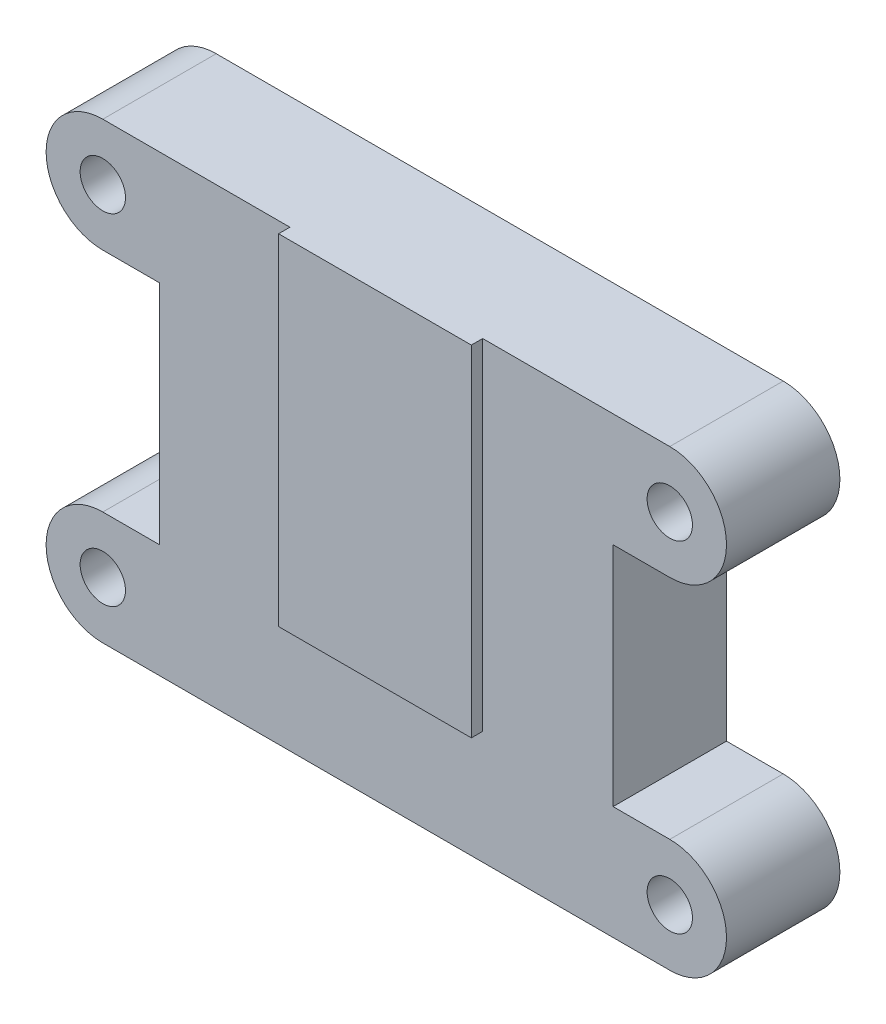
ISO-10303-21;
HEADER;
FILE_DESCRIPTION(('STEP AP214'),'2;1');
FILE_NAME('part.step','',(''),(''),'','','');
FILE_SCHEMA(('AUTOMOTIVE_DESIGN { 1 0 10303 214 1 1 1 1 }'));
ENDSEC;
DATA;
#1=APPLICATION_CONTEXT('core data for automotive mechanical design processes');
#2=APPLICATION_PROTOCOL_DEFINITION('international standard','automotive_design',2000,#1);
#3=PRODUCT_CONTEXT('',#1,'mechanical');
#4=PRODUCT('Part','Part','',(#3));
#5=PRODUCT_RELATED_PRODUCT_CATEGORY('part','',(#4));
#6=PRODUCT_DEFINITION_FORMATION('','',#4);
#7=PRODUCT_DEFINITION_CONTEXT('part definition',#1,'design');
#8=PRODUCT_DEFINITION('design','',#6,#7);
#9=PRODUCT_DEFINITION_SHAPE('','',#8);
#10=(LENGTH_UNIT() NAMED_UNIT(*) SI_UNIT(.MILLI.,.METRE.));
#11=(NAMED_UNIT(*) PLANE_ANGLE_UNIT() SI_UNIT($,.RADIAN.));
#12=(NAMED_UNIT(*) SI_UNIT($,.STERADIAN.) SOLID_ANGLE_UNIT());
#13=UNCERTAINTY_MEASURE_WITH_UNIT(LENGTH_MEASURE(1.E-05),#10,'distance_accuracy_value','');
#14=(GEOMETRIC_REPRESENTATION_CONTEXT(3) GLOBAL_UNCERTAINTY_ASSIGNED_CONTEXT((#13)) GLOBAL_UNIT_ASSIGNED_CONTEXT((#10,
#11,#12)) REPRESENTATION_CONTEXT('',''));
#15=CARTESIAN_POINT('',(0.,0.,0.));
#16=DIRECTION('',(0.,0.,1.));
#17=DIRECTION('',(1.,0.,0.));
#18=AXIS2_PLACEMENT_3D('',#15,#16,#17);
#19=CARTESIAN_POINT('',(31.75,-44.45,12.7));
#20=DIRECTION('',(0.,0.,-1.));
#21=DIRECTION('',(-1.,0.,0.));
#22=AXIS2_PLACEMENT_3D('',#19,#20,#21);
#23=PLANE('',#22);
#24=CARTESIAN_POINT('',(31.75,-44.45,12.7));
#25=DIRECTION('',(0.,0.,1.));
#26=DIRECTION('',(-1.,0.,0.));
#27=AXIS2_PLACEMENT_3D('',#24,#25,#26);
#28=CIRCLE('',#27,2.54);
#29=CARTESIAN_POINT('',(29.21,-44.45,12.7));
#30=VERTEX_POINT('',#29);
#31=EDGE_CURVE('E185',#30,#30,#28,.T.);
#32=ORIENTED_EDGE('',*,*,#31,.F.);
#33=EDGE_LOOP('',(#32));
#34=FACE_BOUND('',#33,.T.);
#35=CARTESIAN_POINT('',(-31.75,-6.35000000000001,12.7));
#36=DIRECTION('',(0.,0.,1.));
#37=DIRECTION('',(1.,0.,0.));
#38=AXIS2_PLACEMENT_3D('',#35,#36,#37);
#39=CIRCLE('',#38,2.54);
#40=CARTESIAN_POINT('',(-29.21,-6.35000000000001,12.7));
#41=VERTEX_POINT('',#40);
#42=EDGE_CURVE('E195',#41,#41,#39,.T.);
#43=ORIENTED_EDGE('',*,*,#42,.F.);
#44=EDGE_LOOP('',(#43));
#45=FACE_BOUND('',#44,.T.);
#46=CARTESIAN_POINT('',(31.75,-6.35,12.7));
#47=DIRECTION('',(0.,0.,1.));
#48=DIRECTION('',(-1.,0.,0.));
#49=AXIS2_PLACEMENT_3D('',#46,#47,#48);
#50=CIRCLE('',#49,2.54);
#51=CARTESIAN_POINT('',(29.21,-6.35,12.7));
#52=VERTEX_POINT('',#51);
#53=EDGE_CURVE('E203',#52,#52,#50,.T.);
#54=ORIENTED_EDGE('',*,*,#53,.F.);
#55=EDGE_LOOP('',(#54));
#56=FACE_BOUND('',#55,.T.);
#57=CARTESIAN_POINT('',(-31.75,-44.45,12.7));
#58=DIRECTION('',(0.,0.,1.));
#59=DIRECTION('',(1.,0.,0.));
#60=AXIS2_PLACEMENT_3D('',#57,#58,#59);
#61=CIRCLE('',#60,2.54);
#62=CARTESIAN_POINT('',(-29.21,-44.45,12.7));
#63=VERTEX_POINT('',#62);
#64=EDGE_CURVE('E211',#63,#63,#61,.T.);
#65=ORIENTED_EDGE('',*,*,#64,.F.);
#66=EDGE_LOOP('',(#65));
#67=FACE_BOUND('',#66,.T.);
#68=DIRECTION('',(0.,-1.,0.));
#69=VECTOR('',#68,1.);
#70=CARTESIAN_POINT('',(-10.795,0.,12.7));
#71=LINE('',#70,#69);
#72=CARTESIAN_POINT('',(-10.795,0.,12.7));
#73=VERTEX_POINT('',#72);
#74=CARTESIAN_POINT('',(-10.795,-38.1,12.7));
#75=VERTEX_POINT('',#74);
#76=EDGE_CURVE('E64',#73,#75,#71,.T.);
#77=ORIENTED_EDGE('',*,*,#76,.F.);
#78=DIRECTION('',(-1.,0.,0.));
#79=VECTOR('',#78,1.);
#80=CARTESIAN_POINT('',(-31.75,0.,12.7));
#81=LINE('',#80,#79);
#82=CARTESIAN_POINT('',(-31.75,0.,12.7));
#83=VERTEX_POINT('',#82);
#84=EDGE_CURVE('E238',#73,#83,#81,.T.);
#85=ORIENTED_EDGE('',*,*,#84,.T.);
#86=CARTESIAN_POINT('',(-31.75,-6.35000000000001,12.7));
#87=DIRECTION('',(0.,0.,1.));
#88=DIRECTION('',(1.,0.,0.));
#89=AXIS2_PLACEMENT_3D('',#86,#87,#88);
#90=CIRCLE('',#89,6.35);
#91=CARTESIAN_POINT('',(-31.75,-12.7,12.7));
#92=VERTEX_POINT('',#91);
#93=EDGE_CURVE('E242',#83,#92,#90,.T.);
#94=ORIENTED_EDGE('',*,*,#93,.T.);
#95=DIRECTION('',(1.,0.,0.));
#96=VECTOR('',#95,1.);
#97=CARTESIAN_POINT('',(-31.75,-12.7,12.7));
#98=LINE('',#97,#96);
#99=CARTESIAN_POINT('',(-25.4,-12.7,12.7));
#100=VERTEX_POINT('',#99);
#101=EDGE_CURVE('E245',#92,#100,#98,.T.);
#102=ORIENTED_EDGE('',*,*,#101,.T.);
#103=DIRECTION('',(0.,-1.,0.));
#104=VECTOR('',#103,1.);
#105=CARTESIAN_POINT('',(-25.4,-12.7,12.7));
#106=LINE('',#105,#104);
#107=CARTESIAN_POINT('',(-25.4,-38.1,12.7));
#108=VERTEX_POINT('',#107);
#109=EDGE_CURVE('E248',#100,#108,#106,.T.);
#110=ORIENTED_EDGE('',*,*,#109,.T.);
#111=DIRECTION('',(-1.,0.,0.));
#112=VECTOR('',#111,1.);
#113=CARTESIAN_POINT('',(-25.4,-38.1,12.7));
#114=LINE('',#113,#112);
#115=CARTESIAN_POINT('',(-31.75,-38.1,12.7));
#116=VERTEX_POINT('',#115);
#117=EDGE_CURVE('E251',#108,#116,#114,.T.);
#118=ORIENTED_EDGE('',*,*,#117,.T.);
#119=CARTESIAN_POINT('',(-31.75,-44.45,12.7));
#120=DIRECTION('',(0.,0.,1.));
#121=DIRECTION('',(1.,0.,0.));
#122=AXIS2_PLACEMENT_3D('',#119,#120,#121);
#123=CIRCLE('',#122,6.34999999999999);
#124=CARTESIAN_POINT('',(-31.75,-50.8,12.7));
#125=VERTEX_POINT('',#124);
#126=EDGE_CURVE('E254',#116,#125,#123,.T.);
#127=ORIENTED_EDGE('',*,*,#126,.T.);
#128=DIRECTION('',(1.,0.,0.));
#129=VECTOR('',#128,1.);
#130=CARTESIAN_POINT('',(-31.75,-50.8,12.7));
#131=LINE('',#130,#129);
#132=CARTESIAN_POINT('',(31.75,-50.8,12.7));
#133=VERTEX_POINT('',#132);
#134=EDGE_CURVE('E219',#125,#133,#131,.T.);
#135=ORIENTED_EDGE('',*,*,#134,.T.);
#136=CARTESIAN_POINT('',(31.75,-44.45,12.7));
#137=DIRECTION('',(0.,0.,1.));
#138=DIRECTION('',(-1.,0.,0.));
#139=AXIS2_PLACEMENT_3D('',#136,#137,#138);
#140=CIRCLE('',#139,6.34999999999999);
#141=CARTESIAN_POINT('',(31.75,-38.1,12.7));
#142=VERTEX_POINT('',#141);
#143=EDGE_CURVE('E222',#133,#142,#140,.T.);
#144=ORIENTED_EDGE('',*,*,#143,.T.);
#145=DIRECTION('',(-1.,0.,0.));
#146=VECTOR('',#145,1.);
#147=CARTESIAN_POINT('',(25.4,-38.1,12.7));
#148=LINE('',#147,#146);
#149=CARTESIAN_POINT('',(25.4,-38.1,12.7));
#150=VERTEX_POINT('',#149);
#151=EDGE_CURVE('E226',#142,#150,#148,.T.);
#152=ORIENTED_EDGE('',*,*,#151,.T.);
#153=DIRECTION('',(0.,1.,0.));
#154=VECTOR('',#153,1.);
#155=CARTESIAN_POINT('',(25.4,-12.7,12.7));
#156=LINE('',#155,#154);
#157=CARTESIAN_POINT('',(25.4,-12.7,12.7));
#158=VERTEX_POINT('',#157);
#159=EDGE_CURVE('E229',#150,#158,#156,.T.);
#160=ORIENTED_EDGE('',*,*,#159,.T.);
#161=DIRECTION('',(1.,0.,0.));
#162=VECTOR('',#161,1.);
#163=CARTESIAN_POINT('',(31.75,-12.7,12.7));
#164=LINE('',#163,#162);
#165=CARTESIAN_POINT('',(31.75,-12.7,12.7));
#166=VERTEX_POINT('',#165);
#167=EDGE_CURVE('E232',#158,#166,#164,.T.);
#168=ORIENTED_EDGE('',*,*,#167,.T.);
#169=CARTESIAN_POINT('',(31.75,-6.35,12.7));
#170=DIRECTION('',(0.,0.,1.));
#171=DIRECTION('',(-1.,0.,0.));
#172=AXIS2_PLACEMENT_3D('',#169,#170,#171);
#173=CIRCLE('',#172,6.35);
#174=CARTESIAN_POINT('',(31.75,0.,12.7));
#175=VERTEX_POINT('',#174);
#176=EDGE_CURVE('E235',#166,#175,#173,.T.);
#177=ORIENTED_EDGE('',*,*,#176,.T.);
#178=CARTESIAN_POINT('',(10.795,0.,12.7));
#179=VERTEX_POINT('',#178);
#180=EDGE_CURVE('E239',#175,#179,#81,.T.);
#181=ORIENTED_EDGE('',*,*,#180,.T.);
#182=DIRECTION('',(0.,1.,0.));
#183=VECTOR('',#182,1.);
#184=CARTESIAN_POINT('',(10.795,0.,12.7));
#185=LINE('',#184,#183);
#186=CARTESIAN_POINT('',(10.795,-38.1,12.7));
#187=VERTEX_POINT('',#186);
#188=EDGE_CURVE('E176',#187,#179,#185,.T.);
#189=ORIENTED_EDGE('',*,*,#188,.F.);
#190=DIRECTION('',(1.,0.,0.));
#191=VECTOR('',#190,1.);
#192=CARTESIAN_POINT('',(-10.795,-38.1,12.7));
#193=LINE('',#192,#191);
#194=EDGE_CURVE('E59',#75,#187,#193,.T.);
#195=ORIENTED_EDGE('',*,*,#194,.F.);
#196=EDGE_LOOP('',(#77,#85,#94,#102,#110,#118,#127,#135,#144,#152,#160,#168,#177,#181,#189,#195));
#197=FACE_BOUND('',#196,.T.);
#198=ADVANCED_FACE('F43',(#34,#45,#56,#67,#197),#23,.F.);
#199=CARTESIAN_POINT('',(31.75,-44.45,0.));
#200=DIRECTION('',(0.,0.,-1.));
#201=DIRECTION('',(-1.,0.,0.));
#202=AXIS2_PLACEMENT_3D('',#199,#200,#201);
#203=PLANE('',#202);
#204=CARTESIAN_POINT('',(-31.75,-6.35000000000001,0.));
#205=DIRECTION('',(0.,0.,1.));
#206=DIRECTION('',(1.,0.,0.));
#207=AXIS2_PLACEMENT_3D('',#204,#205,#206);
#208=CIRCLE('',#207,2.54);
#209=CARTESIAN_POINT('',(-29.21,-6.35000000000001,0.));
#210=VERTEX_POINT('',#209);
#211=EDGE_CURVE('E193',#210,#210,#208,.T.);
#212=ORIENTED_EDGE('',*,*,#211,.T.);
#213=EDGE_LOOP('',(#212));
#214=FACE_BOUND('',#213,.T.);
#215=CARTESIAN_POINT('',(-31.75,-44.45,0.));
#216=DIRECTION('',(0.,0.,1.));
#217=DIRECTION('',(1.,0.,0.));
#218=AXIS2_PLACEMENT_3D('',#215,#216,#217);
#219=CIRCLE('',#218,2.54);
#220=CARTESIAN_POINT('',(-29.21,-44.45,0.));
#221=VERTEX_POINT('',#220);
#222=EDGE_CURVE('E207',#221,#221,#219,.T.);
#223=ORIENTED_EDGE('',*,*,#222,.T.);
#224=EDGE_LOOP('',(#223));
#225=FACE_BOUND('',#224,.T.);
#226=DIRECTION('',(1.,0.,0.));
#227=VECTOR('',#226,1.);
#228=CARTESIAN_POINT('',(31.75,-50.8,0.));
#229=LINE('',#228,#227);
#230=CARTESIAN_POINT('',(-31.75,-50.8,0.));
#231=VERTEX_POINT('',#230);
#232=CARTESIAN_POINT('',(31.75,-50.8,0.));
#233=VERTEX_POINT('',#232);
#234=EDGE_CURVE('E215',#231,#233,#229,.T.);
#235=ORIENTED_EDGE('',*,*,#234,.F.);
#236=CARTESIAN_POINT('',(-31.75,-44.45,0.));
#237=DIRECTION('',(0.,0.,1.));
#238=DIRECTION('',(1.,0.,0.));
#239=AXIS2_PLACEMENT_3D('',#236,#237,#238);
#240=CIRCLE('',#239,6.34999999999999);
#241=CARTESIAN_POINT('',(-31.75,-38.1,0.));
#242=VERTEX_POINT('',#241);
#243=EDGE_CURVE('E223',#242,#231,#240,.T.);
#244=ORIENTED_EDGE('',*,*,#243,.F.);
#245=DIRECTION('',(-1.,0.,0.));
#246=VECTOR('',#245,1.);
#247=CARTESIAN_POINT('',(-25.4,-38.1,0.));
#248=LINE('',#247,#246);
#249=CARTESIAN_POINT('',(-25.4,-38.1,0.));
#250=VERTEX_POINT('',#249);
#251=EDGE_CURVE('E287',#250,#242,#248,.T.);
#252=ORIENTED_EDGE('',*,*,#251,.F.);
#253=DIRECTION('',(0.,-1.,0.));
#254=VECTOR('',#253,1.);
#255=CARTESIAN_POINT('',(-25.4,-12.7,0.));
#256=LINE('',#255,#254);
#257=CARTESIAN_POINT('',(-25.4,-12.7,0.));
#258=VERTEX_POINT('',#257);
#259=EDGE_CURVE('E284',#258,#250,#256,.T.);
#260=ORIENTED_EDGE('',*,*,#259,.F.);
#261=DIRECTION('',(1.,0.,0.));
#262=VECTOR('',#261,1.);
#263=CARTESIAN_POINT('',(-31.75,-12.7,0.));
#264=LINE('',#263,#262);
#265=CARTESIAN_POINT('',(-31.75,-12.7,0.));
#266=VERTEX_POINT('',#265);
#267=EDGE_CURVE('E281',#266,#258,#264,.T.);
#268=ORIENTED_EDGE('',*,*,#267,.F.);
#269=CARTESIAN_POINT('',(-31.75,-6.35000000000001,0.));
#270=DIRECTION('',(0.,0.,1.));
#271=DIRECTION('',(1.,0.,0.));
#272=AXIS2_PLACEMENT_3D('',#269,#270,#271);
#273=CIRCLE('',#272,6.35);
#274=CARTESIAN_POINT('',(-31.75,0.,0.));
#275=VERTEX_POINT('',#274);
#276=EDGE_CURVE('E278',#275,#266,#273,.T.);
#277=ORIENTED_EDGE('',*,*,#276,.F.);
#278=DIRECTION('',(-1.,0.,0.));
#279=VECTOR('',#278,1.);
#280=CARTESIAN_POINT('',(-31.75,0.,0.));
#281=LINE('',#280,#279);
#282=CARTESIAN_POINT('',(31.75,0.,0.));
#283=VERTEX_POINT('',#282);
#284=EDGE_CURVE('E275',#283,#275,#281,.T.);
#285=ORIENTED_EDGE('',*,*,#284,.F.);
#286=CARTESIAN_POINT('',(31.75,-6.35,0.));
#287=DIRECTION('',(0.,0.,1.));
#288=DIRECTION('',(-1.,0.,0.));
#289=AXIS2_PLACEMENT_3D('',#286,#287,#288);
#290=CIRCLE('',#289,6.35);
#291=CARTESIAN_POINT('',(31.75,-12.7,0.));
#292=VERTEX_POINT('',#291);
#293=EDGE_CURVE('E272',#292,#283,#290,.T.);
#294=ORIENTED_EDGE('',*,*,#293,.F.);
#295=DIRECTION('',(1.,0.,0.));
#296=VECTOR('',#295,1.);
#297=CARTESIAN_POINT('',(31.75,-12.7,0.));
#298=LINE('',#297,#296);
#299=CARTESIAN_POINT('',(25.4,-12.7,0.));
#300=VERTEX_POINT('',#299);
#301=EDGE_CURVE('E269',#300,#292,#298,.T.);
#302=ORIENTED_EDGE('',*,*,#301,.F.);
#303=DIRECTION('',(0.,1.,0.));
#304=VECTOR('',#303,1.);
#305=CARTESIAN_POINT('',(25.4,-12.7,0.));
#306=LINE('',#305,#304);
#307=CARTESIAN_POINT('',(25.4,-38.1,0.));
#308=VERTEX_POINT('',#307);
#309=EDGE_CURVE('E266',#308,#300,#306,.T.);
#310=ORIENTED_EDGE('',*,*,#309,.F.);
#311=DIRECTION('',(-1.,0.,0.));
#312=VECTOR('',#311,1.);
#313=CARTESIAN_POINT('',(25.4,-38.1,0.));
#314=LINE('',#313,#312);
#315=CARTESIAN_POINT('',(31.75,-38.1,0.));
#316=VERTEX_POINT('',#315);
#317=EDGE_CURVE('E263',#316,#308,#314,.T.);
#318=ORIENTED_EDGE('',*,*,#317,.F.);
#319=CARTESIAN_POINT('',(31.75,-44.45,0.));
#320=DIRECTION('',(0.,0.,1.));
#321=DIRECTION('',(-1.,0.,0.));
#322=AXIS2_PLACEMENT_3D('',#319,#320,#321);
#323=CIRCLE('',#322,6.34999999999999);
#324=EDGE_CURVE('E260',#233,#316,#323,.T.);
#325=ORIENTED_EDGE('',*,*,#324,.F.);
#326=EDGE_LOOP('',(#235,#244,#252,#260,#268,#277,#285,#294,#302,#310,#318,#325));
#327=FACE_BOUND('',#326,.T.);
#328=CARTESIAN_POINT('',(31.75,-6.35,0.));
#329=DIRECTION('',(0.,0.,1.));
#330=DIRECTION('',(-1.,0.,0.));
#331=AXIS2_PLACEMENT_3D('',#328,#329,#330);
#332=CIRCLE('',#331,2.54);
#333=CARTESIAN_POINT('',(29.21,-6.35,0.));
#334=VERTEX_POINT('',#333);
#335=EDGE_CURVE('E199',#334,#334,#332,.T.);
#336=ORIENTED_EDGE('',*,*,#335,.T.);
#337=EDGE_LOOP('',(#336));
#338=FACE_BOUND('',#337,.T.);
#339=CARTESIAN_POINT('',(31.75,-44.45,0.));
#340=DIRECTION('',(0.,0.,1.));
#341=DIRECTION('',(-1.,0.,0.));
#342=AXIS2_PLACEMENT_3D('',#339,#340,#341);
#343=CIRCLE('',#342,2.54);
#344=CARTESIAN_POINT('',(29.21,-44.45,0.));
#345=VERTEX_POINT('',#344);
#346=EDGE_CURVE('E180',#345,#345,#343,.T.);
#347=ORIENTED_EDGE('',*,*,#346,.T.);
#348=EDGE_LOOP('',(#347));
#349=FACE_BOUND('',#348,.T.);
#350=ADVANCED_FACE('F344',(#214,#225,#327,#338,#349),#203,.T.);
#351=CARTESIAN_POINT('',(31.75,-50.8,12.7));
#352=DIRECTION('',(0.,1.,0.));
#353=DIRECTION('',(-1.,0.,0.));
#354=AXIS2_PLACEMENT_3D('',#351,#352,#353);
#355=PLANE('',#354);
#356=ORIENTED_EDGE('',*,*,#234,.T.);
#357=DIRECTION('',(0.,0.,-1.));
#358=VECTOR('',#357,1.);
#359=CARTESIAN_POINT('',(31.75,-50.8,12.7));
#360=LINE('',#359,#358);
#361=EDGE_CURVE('E11',#133,#233,#360,.T.);
#362=ORIENTED_EDGE('',*,*,#361,.F.);
#363=ORIENTED_EDGE('',*,*,#134,.F.);
#364=DIRECTION('',(0.,0.,-1.));
#365=VECTOR('',#364,1.);
#366=CARTESIAN_POINT('',(-31.75,-50.8,12.7));
#367=LINE('',#366,#365);
#368=EDGE_CURVE('E257',#125,#231,#367,.T.);
#369=ORIENTED_EDGE('',*,*,#368,.T.);
#370=EDGE_LOOP('',(#356,#362,#363,#369));
#371=FACE_BOUND('',#370,.T.);
#372=ADVANCED_FACE('F45',(#371),#355,.F.);
#373=CARTESIAN_POINT('',(31.75,-44.45,12.7));
#374=DIRECTION('',(0.,0.,-1.));
#375=DIRECTION('',(-1.,0.,0.));
#376=AXIS2_PLACEMENT_3D('',#373,#374,#375);
#377=CYLINDRICAL_SURFACE('',#376,6.34999999999999);
#378=ORIENTED_EDGE('',*,*,#324,.T.);
#379=DIRECTION('',(0.,0.,-1.));
#380=VECTOR('',#379,1.);
#381=CARTESIAN_POINT('',(31.75,-38.1,12.7));
#382=LINE('',#381,#380);
#383=EDGE_CURVE('E52',#142,#316,#382,.T.);
#384=ORIENTED_EDGE('',*,*,#383,.F.);
#385=ORIENTED_EDGE('',*,*,#143,.F.);
#386=ORIENTED_EDGE('',*,*,#361,.T.);
#387=EDGE_LOOP('',(#378,#384,#385,#386));
#388=FACE_BOUND('',#387,.T.);
#389=ADVANCED_FACE('F360',(#388),#377,.T.);
#390=CARTESIAN_POINT('',(25.4,-38.1,12.7));
#391=DIRECTION('',(0.,-1.,0.));
#392=DIRECTION('',(1.,0.,0.));
#393=AXIS2_PLACEMENT_3D('',#390,#391,#392);
#394=PLANE('',#393);
#395=ORIENTED_EDGE('',*,*,#317,.T.);
#396=DIRECTION('',(0.,0.,-1.));
#397=VECTOR('',#396,1.);
#398=CARTESIAN_POINT('',(25.4,-38.1,12.7));
#399=LINE('',#398,#397);
#400=EDGE_CURVE('E328',#150,#308,#399,.T.);
#401=ORIENTED_EDGE('',*,*,#400,.F.);
#402=ORIENTED_EDGE('',*,*,#151,.F.);
#403=ORIENTED_EDGE('',*,*,#383,.T.);
#404=EDGE_LOOP('',(#395,#401,#402,#403));
#405=FACE_BOUND('',#404,.T.);
#406=ADVANCED_FACE('F337',(#405),#394,.F.);
#407=CARTESIAN_POINT('',(25.4,-12.7,12.7));
#408=DIRECTION('',(-1.,0.,0.));
#409=DIRECTION('',(0.,-1.,0.));
#410=AXIS2_PLACEMENT_3D('',#407,#408,#409);
#411=PLANE('',#410);
#412=ORIENTED_EDGE('',*,*,#309,.T.);
#413=DIRECTION('',(0.,0.,-1.));
#414=VECTOR('',#413,1.);
#415=CARTESIAN_POINT('',(25.4,-12.7,12.7));
#416=LINE('',#415,#414);
#417=EDGE_CURVE('E324',#158,#300,#416,.T.);
#418=ORIENTED_EDGE('',*,*,#417,.F.);
#419=ORIENTED_EDGE('',*,*,#159,.F.);
#420=ORIENTED_EDGE('',*,*,#400,.T.);
#421=EDGE_LOOP('',(#412,#418,#419,#420));
#422=FACE_BOUND('',#421,.T.);
#423=ADVANCED_FACE('F350',(#422),#411,.F.);
#424=CARTESIAN_POINT('',(31.75,-12.7,12.7));
#425=DIRECTION('',(0.,1.,0.));
#426=DIRECTION('',(-1.,0.,0.));
#427=AXIS2_PLACEMENT_3D('',#424,#425,#426);
#428=PLANE('',#427);
#429=ORIENTED_EDGE('',*,*,#301,.T.);
#430=DIRECTION('',(0.,0.,-1.));
#431=VECTOR('',#430,1.);
#432=CARTESIAN_POINT('',(31.75,-12.7,12.7));
#433=LINE('',#432,#431);
#434=EDGE_CURVE('E320',#166,#292,#433,.T.);
#435=ORIENTED_EDGE('',*,*,#434,.F.);
#436=ORIENTED_EDGE('',*,*,#167,.F.);
#437=ORIENTED_EDGE('',*,*,#417,.T.);
#438=EDGE_LOOP('',(#429,#435,#436,#437));
#439=FACE_BOUND('',#438,.T.);
#440=ADVANCED_FACE('F354',(#439),#428,.F.);
#441=CARTESIAN_POINT('',(31.75,-6.35,12.7));
#442=DIRECTION('',(0.,0.,-1.));
#443=DIRECTION('',(-1.,0.,0.));
#444=AXIS2_PLACEMENT_3D('',#441,#442,#443);
#445=CYLINDRICAL_SURFACE('',#444,6.35);
#446=ORIENTED_EDGE('',*,*,#293,.T.);
#447=DIRECTION('',(0.,0.,-1.));
#448=VECTOR('',#447,1.);
#449=CARTESIAN_POINT('',(31.75,0.,12.7));
#450=LINE('',#449,#448);
#451=EDGE_CURVE('E316',#175,#283,#450,.T.);
#452=ORIENTED_EDGE('',*,*,#451,.F.);
#453=ORIENTED_EDGE('',*,*,#176,.F.);
#454=ORIENTED_EDGE('',*,*,#434,.T.);
#455=EDGE_LOOP('',(#446,#452,#453,#454));
#456=FACE_BOUND('',#455,.T.);
#457=ADVANCED_FACE('F394',(#456),#445,.T.);
#458=CARTESIAN_POINT('',(-31.75,0.,12.7));
#459=DIRECTION('',(0.,-1.,0.));
#460=DIRECTION('',(1.,0.,0.));
#461=AXIS2_PLACEMENT_3D('',#458,#459,#460);
#462=PLANE('',#461);
#463=ORIENTED_EDGE('',*,*,#284,.T.);
#464=DIRECTION('',(0.,0.,-1.));
#465=VECTOR('',#464,1.);
#466=CARTESIAN_POINT('',(-31.75,0.,12.7));
#467=LINE('',#466,#465);
#468=EDGE_CURVE('E312',#83,#275,#467,.T.);
#469=ORIENTED_EDGE('',*,*,#468,.F.);
#470=ORIENTED_EDGE('',*,*,#84,.F.);
#471=DIRECTION('',(0.,0.,-1.));
#472=VECTOR('',#471,1.);
#473=CARTESIAN_POINT('',(-10.795,0.,13.97));
#474=LINE('',#473,#472);
#475=CARTESIAN_POINT('',(-10.795,0.,13.97));
#476=VERTEX_POINT('',#475);
#477=EDGE_CURVE('E638',#476,#73,#474,.T.);
#478=ORIENTED_EDGE('',*,*,#477,.F.);
#479=DIRECTION('',(-1.,0.,0.));
#480=VECTOR('',#479,1.);
#481=CARTESIAN_POINT('',(-10.795,0.,13.97));
#482=LINE('',#481,#480);
#483=CARTESIAN_POINT('',(10.795,0.,13.97));
#484=VERTEX_POINT('',#483);
#485=EDGE_CURVE('E171',#484,#476,#482,.T.);
#486=ORIENTED_EDGE('',*,*,#485,.F.);
#487=DIRECTION('',(0.,0.,-1.));
#488=VECTOR('',#487,1.);
#489=CARTESIAN_POINT('',(10.795,0.,13.97));
#490=LINE('',#489,#488);
#491=EDGE_CURVE('E187',#484,#179,#490,.T.);
#492=ORIENTED_EDGE('',*,*,#491,.T.);
#493=ORIENTED_EDGE('',*,*,#180,.F.);
#494=ORIENTED_EDGE('',*,*,#451,.T.);
#495=EDGE_LOOP('',(#463,#469,#470,#478,#486,#492,#493,#494));
#496=FACE_BOUND('',#495,.T.);
#497=ADVANCED_FACE('F390',(#496),#462,.F.);
#498=CARTESIAN_POINT('',(-31.75,-6.35000000000001,12.7));
#499=DIRECTION('',(0.,0.,-1.));
#500=DIRECTION('',(-1.,0.,0.));
#501=AXIS2_PLACEMENT_3D('',#498,#499,#500);
#502=CYLINDRICAL_SURFACE('',#501,6.35);
#503=ORIENTED_EDGE('',*,*,#276,.T.);
#504=DIRECTION('',(0.,0.,-1.));
#505=VECTOR('',#504,1.);
#506=CARTESIAN_POINT('',(-31.75,-12.7,12.7));
#507=LINE('',#506,#505);
#508=EDGE_CURVE('E308',#92,#266,#507,.T.);
#509=ORIENTED_EDGE('',*,*,#508,.F.);
#510=ORIENTED_EDGE('',*,*,#93,.F.);
#511=ORIENTED_EDGE('',*,*,#468,.T.);
#512=EDGE_LOOP('',(#503,#509,#510,#511));
#513=FACE_BOUND('',#512,.T.);
#514=ADVANCED_FACE('F386',(#513),#502,.T.);
#515=CARTESIAN_POINT('',(-31.75,-12.7,12.7));
#516=DIRECTION('',(0.,1.,0.));
#517=DIRECTION('',(-1.,0.,0.));
#518=AXIS2_PLACEMENT_3D('',#515,#516,#517);
#519=PLANE('',#518);
#520=ORIENTED_EDGE('',*,*,#267,.T.);
#521=DIRECTION('',(0.,0.,-1.));
#522=VECTOR('',#521,1.);
#523=CARTESIAN_POINT('',(-25.4,-12.7,12.7));
#524=LINE('',#523,#522);
#525=EDGE_CURVE('E304',#100,#258,#524,.T.);
#526=ORIENTED_EDGE('',*,*,#525,.F.);
#527=ORIENTED_EDGE('',*,*,#101,.F.);
#528=ORIENTED_EDGE('',*,*,#508,.T.);
#529=EDGE_LOOP('',(#520,#526,#527,#528));
#530=FACE_BOUND('',#529,.T.);
#531=ADVANCED_FACE('F382',(#530),#519,.F.);
#532=CARTESIAN_POINT('',(-25.4,-12.7,12.7));
#533=DIRECTION('',(1.,0.,0.));
#534=DIRECTION('',(0.,1.,0.));
#535=AXIS2_PLACEMENT_3D('',#532,#533,#534);
#536=PLANE('',#535);
#537=ORIENTED_EDGE('',*,*,#259,.T.);
#538=DIRECTION('',(0.,0.,-1.));
#539=VECTOR('',#538,1.);
#540=CARTESIAN_POINT('',(-25.4,-38.1,12.7));
#541=LINE('',#540,#539);
#542=EDGE_CURVE('E300',#108,#250,#541,.T.);
#543=ORIENTED_EDGE('',*,*,#542,.F.);
#544=ORIENTED_EDGE('',*,*,#109,.F.);
#545=ORIENTED_EDGE('',*,*,#525,.T.);
#546=EDGE_LOOP('',(#537,#543,#544,#545));
#547=FACE_BOUND('',#546,.T.);
#548=ADVANCED_FACE('F377',(#547),#536,.F.);
#549=CARTESIAN_POINT('',(-25.4,-38.1,12.7));
#550=DIRECTION('',(0.,-1.,0.));
#551=DIRECTION('',(1.,0.,0.));
#552=AXIS2_PLACEMENT_3D('',#549,#550,#551);
#553=PLANE('',#552);
#554=ORIENTED_EDGE('',*,*,#251,.T.);
#555=DIRECTION('',(0.,0.,-1.));
#556=VECTOR('',#555,1.);
#557=CARTESIAN_POINT('',(-31.75,-38.1,12.7));
#558=LINE('',#557,#556);
#559=EDGE_CURVE('E296',#116,#242,#558,.T.);
#560=ORIENTED_EDGE('',*,*,#559,.F.);
#561=ORIENTED_EDGE('',*,*,#117,.F.);
#562=ORIENTED_EDGE('',*,*,#542,.T.);
#563=EDGE_LOOP('',(#554,#560,#561,#562));
#564=FACE_BOUND('',#563,.T.);
#565=ADVANCED_FACE('F371',(#564),#553,.F.);
#566=CARTESIAN_POINT('',(-31.75,-44.45,12.7));
#567=DIRECTION('',(0.,0.,-1.));
#568=DIRECTION('',(-1.,0.,0.));
#569=AXIS2_PLACEMENT_3D('',#566,#567,#568);
#570=CYLINDRICAL_SURFACE('',#569,6.34999999999999);
#571=ORIENTED_EDGE('',*,*,#243,.T.);
#572=ORIENTED_EDGE('',*,*,#368,.F.);
#573=ORIENTED_EDGE('',*,*,#126,.F.);
#574=ORIENTED_EDGE('',*,*,#559,.T.);
#575=EDGE_LOOP('',(#571,#572,#573,#574));
#576=FACE_BOUND('',#575,.T.);
#577=ADVANCED_FACE('F366',(#576),#570,.T.);
#578=CARTESIAN_POINT('',(-31.75,-44.45,12.7));
#579=DIRECTION('',(0.,0.,-1.));
#580=DIRECTION('',(-1.,0.,0.));
#581=AXIS2_PLACEMENT_3D('',#578,#579,#580);
#582=CYLINDRICAL_SURFACE('',#581,2.54);
#583=ORIENTED_EDGE('',*,*,#64,.T.);
#584=EDGE_LOOP('',(#583));
#585=FACE_BOUND('',#584,.T.);
#586=ORIENTED_EDGE('',*,*,#222,.F.);
#587=EDGE_LOOP('',(#586));
#588=FACE_BOUND('',#587,.T.);
#589=ADVANCED_FACE('F414',(#585,#588),#582,.F.);
#590=CARTESIAN_POINT('',(31.75,-6.35,12.7));
#591=DIRECTION('',(0.,0.,-1.));
#592=DIRECTION('',(-1.,0.,0.));
#593=AXIS2_PLACEMENT_3D('',#590,#591,#592);
#594=CYLINDRICAL_SURFACE('',#593,2.54);
#595=ORIENTED_EDGE('',*,*,#53,.T.);
#596=EDGE_LOOP('',(#595));
#597=FACE_BOUND('',#596,.T.);
#598=ORIENTED_EDGE('',*,*,#335,.F.);
#599=EDGE_LOOP('',(#598));
#600=FACE_BOUND('',#599,.T.);
#601=ADVANCED_FACE('F452',(#597,#600),#594,.F.);
#602=CARTESIAN_POINT('',(-31.75,-6.35000000000001,12.7));
#603=DIRECTION('',(0.,0.,-1.));
#604=DIRECTION('',(-1.,0.,0.));
#605=AXIS2_PLACEMENT_3D('',#602,#603,#604);
#606=CYLINDRICAL_SURFACE('',#605,2.54);
#607=ORIENTED_EDGE('',*,*,#42,.T.);
#608=EDGE_LOOP('',(#607));
#609=FACE_BOUND('',#608,.T.);
#610=ORIENTED_EDGE('',*,*,#211,.F.);
#611=EDGE_LOOP('',(#610));
#612=FACE_BOUND('',#611,.T.);
#613=ADVANCED_FACE('F459',(#609,#612),#606,.F.);
#614=CARTESIAN_POINT('',(31.75,-44.45,12.7));
#615=DIRECTION('',(0.,0.,-1.));
#616=DIRECTION('',(-1.,0.,0.));
#617=AXIS2_PLACEMENT_3D('',#614,#615,#616);
#618=CYLINDRICAL_SURFACE('',#617,2.54);
#619=ORIENTED_EDGE('',*,*,#31,.T.);
#620=EDGE_LOOP('',(#619));
#621=FACE_BOUND('',#620,.T.);
#622=ORIENTED_EDGE('',*,*,#346,.F.);
#623=EDGE_LOOP('',(#622));
#624=FACE_BOUND('',#623,.T.);
#625=ADVANCED_FACE('F466',(#621,#624),#618,.F.);
#626=CARTESIAN_POINT('',(-10.795,0.,13.97));
#627=DIRECTION('',(1.,0.,0.));
#628=DIRECTION('',(0.,1.,0.));
#629=AXIS2_PLACEMENT_3D('',#626,#627,#628);
#630=PLANE('',#629);
#631=ORIENTED_EDGE('',*,*,#76,.T.);
#632=DIRECTION('',(0.,0.,-1.));
#633=VECTOR('',#632,1.);
#634=CARTESIAN_POINT('',(-10.795,-38.1,13.97));
#635=LINE('',#634,#633);
#636=CARTESIAN_POINT('',(-10.795,-38.1,13.97));
#637=VERTEX_POINT('',#636);
#638=EDGE_CURVE('E159',#637,#75,#635,.T.);
#639=ORIENTED_EDGE('',*,*,#638,.F.);
#640=DIRECTION('',(0.,-1.,0.));
#641=VECTOR('',#640,1.);
#642=CARTESIAN_POINT('',(-10.795,0.,13.97));
#643=LINE('',#642,#641);
#644=EDGE_CURVE('E166',#476,#637,#643,.T.);
#645=ORIENTED_EDGE('',*,*,#644,.F.);
#646=ORIENTED_EDGE('',*,*,#477,.T.);
#647=EDGE_LOOP('',(#631,#639,#645,#646));
#648=FACE_BOUND('',#647,.T.);
#649=ADVANCED_FACE('F178',(#648),#630,.F.);
#650=CARTESIAN_POINT('',(-10.795,-38.1,13.97));
#651=DIRECTION('',(0.,1.,0.));
#652=DIRECTION('',(0.,0.,1.));
#653=AXIS2_PLACEMENT_3D('',#650,#651,#652);
#654=PLANE('',#653);
#655=ORIENTED_EDGE('',*,*,#194,.T.);
#656=DIRECTION('',(0.,0.,-1.));
#657=VECTOR('',#656,1.);
#658=CARTESIAN_POINT('',(10.795,-38.1,13.97));
#659=LINE('',#658,#657);
#660=CARTESIAN_POINT('',(10.795,-38.1,13.97));
#661=VERTEX_POINT('',#660);
#662=EDGE_CURVE('E161',#661,#187,#659,.T.);
#663=ORIENTED_EDGE('',*,*,#662,.F.);
#664=DIRECTION('',(1.,0.,0.));
#665=VECTOR('',#664,1.);
#666=CARTESIAN_POINT('',(-10.795,-38.1,13.97));
#667=LINE('',#666,#665);
#668=EDGE_CURVE('E155',#637,#661,#667,.T.);
#669=ORIENTED_EDGE('',*,*,#668,.F.);
#670=ORIENTED_EDGE('',*,*,#638,.T.);
#671=EDGE_LOOP('',(#655,#663,#669,#670));
#672=FACE_BOUND('',#671,.T.);
#673=ADVANCED_FACE('F157',(#672),#654,.F.);
#674=CARTESIAN_POINT('',(10.795,0.,13.97));
#675=DIRECTION('',(-1.,0.,0.));
#676=DIRECTION('',(0.,0.,1.));
#677=AXIS2_PLACEMENT_3D('',#674,#675,#676);
#678=PLANE('',#677);
#679=ORIENTED_EDGE('',*,*,#188,.T.);
#680=ORIENTED_EDGE('',*,*,#491,.F.);
#681=DIRECTION('',(0.,1.,0.));
#682=VECTOR('',#681,1.);
#683=CARTESIAN_POINT('',(10.795,0.,13.97));
#684=LINE('',#683,#682);
#685=EDGE_CURVE('E165',#661,#484,#684,.T.);
#686=ORIENTED_EDGE('',*,*,#685,.F.);
#687=ORIENTED_EDGE('',*,*,#662,.T.);
#688=EDGE_LOOP('',(#679,#680,#686,#687));
#689=FACE_BOUND('',#688,.T.);
#690=ADVANCED_FACE('F487',(#689),#678,.F.);
#691=CARTESIAN_POINT('',(0.,0.,13.97));
#692=DIRECTION('',(0.,0.,1.));
#693=DIRECTION('',(1.,0.,0.));
#694=AXIS2_PLACEMENT_3D('',#691,#692,#693);
#695=PLANE('',#694);
#696=ORIENTED_EDGE('',*,*,#644,.T.);
#697=ORIENTED_EDGE('',*,*,#668,.T.);
#698=ORIENTED_EDGE('',*,*,#685,.T.);
#699=ORIENTED_EDGE('',*,*,#485,.T.);
#700=EDGE_LOOP('',(#696,#697,#698,#699));
#701=FACE_BOUND('',#700,.T.);
#702=ADVANCED_FACE('F169',(#701),#695,.T.);
#703=CLOSED_SHELL('',(#198,#350,#372,#389,#406,#423,#440,#457,#497,#514,#531,#548,#565,#577,
#589,#601,#613,#625,#649,#673,#690,#702));
#704=MANIFOLD_SOLID_BREP('B2',#703);
#705=ADVANCED_BREP_SHAPE_REPRESENTATION('',(#18,#704),#14);
#706=SHAPE_DEFINITION_REPRESENTATION(#9,#705);
ENDSEC;
END-ISO-10303-21;
